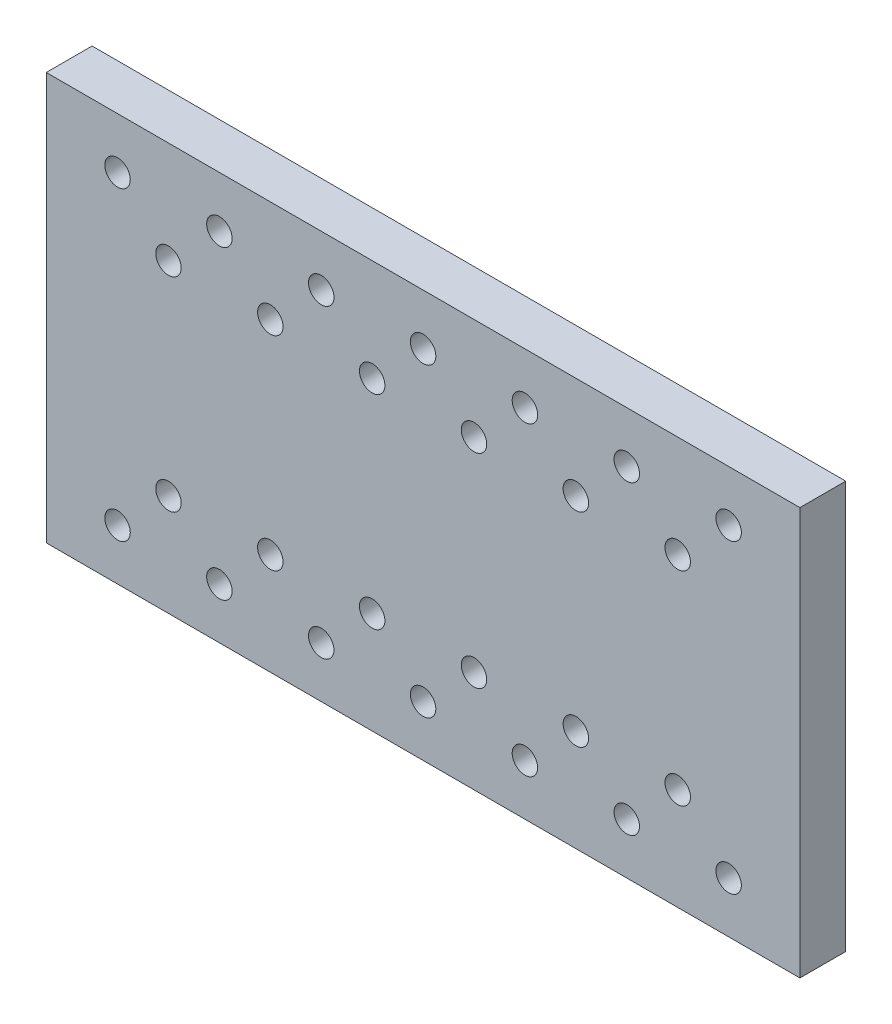
ISO-10303-21;
HEADER;
FILE_DESCRIPTION(('STEP AP214'),'2;1');
FILE_NAME('part.step','',(''),(''),'','','');
FILE_SCHEMA(('AUTOMOTIVE_DESIGN { 1 0 10303 214 1 1 1 1 }'));
ENDSEC;
DATA;
#1=APPLICATION_CONTEXT('core data for automotive mechanical design processes');
#2=APPLICATION_PROTOCOL_DEFINITION('international standard','automotive_design',2000,#1);
#3=PRODUCT_CONTEXT('',#1,'mechanical');
#4=PRODUCT('Part','Part','',(#3));
#5=PRODUCT_RELATED_PRODUCT_CATEGORY('part','',(#4));
#6=PRODUCT_DEFINITION_FORMATION('','',#4);
#7=PRODUCT_DEFINITION_CONTEXT('part definition',#1,'design');
#8=PRODUCT_DEFINITION('design','',#6,#7);
#9=PRODUCT_DEFINITION_SHAPE('','',#8);
#10=(LENGTH_UNIT() NAMED_UNIT(*) SI_UNIT(.MILLI.,.METRE.));
#11=(NAMED_UNIT(*) PLANE_ANGLE_UNIT() SI_UNIT($,.RADIAN.));
#12=(NAMED_UNIT(*) SI_UNIT($,.STERADIAN.) SOLID_ANGLE_UNIT());
#13=UNCERTAINTY_MEASURE_WITH_UNIT(LENGTH_MEASURE(1.E-05),#10,'distance_accuracy_value','');
#14=(GEOMETRIC_REPRESENTATION_CONTEXT(3) GLOBAL_UNCERTAINTY_ASSIGNED_CONTEXT((#13)) GLOBAL_UNIT_ASSIGNED_CONTEXT((#10,
#11,#12)) REPRESENTATION_CONTEXT('',''));
#15=CARTESIAN_POINT('',(0.,0.,0.));
#16=DIRECTION('',(0.,0.,1.));
#17=DIRECTION('',(1.,0.,0.));
#18=AXIS2_PLACEMENT_3D('',#15,#16,#17);
#19=CARTESIAN_POINT('',(0.,101.6,11.43));
#20=DIRECTION('',(0.,0.,1.));
#21=DIRECTION('',(1.,0.,0.));
#22=AXIS2_PLACEMENT_3D('',#19,#20,#21);
#23=PLANE('',#22);
#24=CARTESIAN_POINT('',(-55.88,25.4,11.43));
#25=DIRECTION('',(0.,0.,1.));
#26=DIRECTION('',(1.,0.,0.));
#27=AXIS2_PLACEMENT_3D('',#24,#25,#26);
#28=CIRCLE('',#27,3.175);
#29=CARTESIAN_POINT('',(-52.705,25.4,11.43));
#30=VERTEX_POINT('',#29);
#31=EDGE_CURVE('E255',#30,#30,#28,.T.);
#32=ORIENTED_EDGE('',*,*,#31,.F.);
#33=EDGE_LOOP('',(#32));
#34=FACE_BOUND('',#33,.T.);
#35=CARTESIAN_POINT('',(-30.48,76.2,11.43));
#36=DIRECTION('',(0.,0.,1.));
#37=DIRECTION('',(1.,0.,0.));
#38=AXIS2_PLACEMENT_3D('',#35,#36,#37);
#39=CIRCLE('',#38,3.175);
#40=CARTESIAN_POINT('',(-27.305,76.2,11.43));
#41=VERTEX_POINT('',#40);
#42=EDGE_CURVE('E243',#41,#41,#39,.T.);
#43=ORIENTED_EDGE('',*,*,#42,.F.);
#44=EDGE_LOOP('',(#43));
#45=FACE_BOUND('',#44,.T.);
#46=CARTESIAN_POINT('',(-81.28,76.2,11.43));
#47=DIRECTION('',(0.,0.,1.));
#48=DIRECTION('',(1.,0.,0.));
#49=AXIS2_PLACEMENT_3D('',#46,#47,#48);
#50=CIRCLE('',#49,3.175);
#51=CARTESIAN_POINT('',(-78.105,76.2,11.43));
#52=VERTEX_POINT('',#51);
#53=EDGE_CURVE('E231',#52,#52,#50,.T.);
#54=ORIENTED_EDGE('',*,*,#53,.F.);
#55=EDGE_LOOP('',(#54));
#56=FACE_BOUND('',#55,.T.);
#57=CARTESIAN_POINT('',(-132.08,25.4,11.43));
#58=DIRECTION('',(0.,0.,1.));
#59=DIRECTION('',(1.,0.,0.));
#60=AXIS2_PLACEMENT_3D('',#57,#58,#59);
#61=CIRCLE('',#60,3.175);
#62=CARTESIAN_POINT('',(-128.905,25.4,11.43));
#63=VERTEX_POINT('',#62);
#64=EDGE_CURVE('E219',#63,#63,#61,.T.);
#65=ORIENTED_EDGE('',*,*,#64,.F.);
#66=EDGE_LOOP('',(#65));
#67=FACE_BOUND('',#66,.T.);
#68=CARTESIAN_POINT('',(-157.48,76.2,11.43));
#69=DIRECTION('',(0.,0.,1.));
#70=DIRECTION('',(1.,0.,0.));
#71=AXIS2_PLACEMENT_3D('',#68,#69,#70);
#72=CIRCLE('',#71,3.175);
#73=CARTESIAN_POINT('',(-154.305,76.2,11.43));
#74=VERTEX_POINT('',#73);
#75=EDGE_CURVE('E207',#74,#74,#72,.T.);
#76=ORIENTED_EDGE('',*,*,#75,.F.);
#77=EDGE_LOOP('',(#76));
#78=FACE_BOUND('',#77,.T.);
#79=CARTESIAN_POINT('',(-106.68,76.2,11.43));
#80=DIRECTION('',(0.,0.,1.));
#81=DIRECTION('',(1.,0.,0.));
#82=AXIS2_PLACEMENT_3D('',#79,#80,#81);
#83=CIRCLE('',#82,3.175);
#84=CARTESIAN_POINT('',(-103.505,76.2,11.43));
#85=VERTEX_POINT('',#84);
#86=EDGE_CURVE('E195',#85,#85,#83,.T.);
#87=ORIENTED_EDGE('',*,*,#86,.F.);
#88=EDGE_LOOP('',(#87));
#89=FACE_BOUND('',#88,.T.);
#90=CARTESIAN_POINT('',(-93.98,88.9,11.43));
#91=DIRECTION('',(0.,0.,1.));
#92=DIRECTION('',(1.,0.,0.));
#93=AXIS2_PLACEMENT_3D('',#90,#91,#92);
#94=CIRCLE('',#93,3.175);
#95=CARTESIAN_POINT('',(-90.805,88.9,11.43));
#96=VERTEX_POINT('',#95);
#97=EDGE_CURVE('E183',#96,#96,#94,.T.);
#98=ORIENTED_EDGE('',*,*,#97,.F.);
#99=EDGE_LOOP('',(#98));
#100=FACE_BOUND('',#99,.T.);
#101=CARTESIAN_POINT('',(-119.38,12.7,11.43));
#102=DIRECTION('',(0.,0.,1.));
#103=DIRECTION('',(1.,0.,0.));
#104=AXIS2_PLACEMENT_3D('',#101,#102,#103);
#105=CIRCLE('',#104,3.175);
#106=CARTESIAN_POINT('',(-116.205,12.7,11.43));
#107=VERTEX_POINT('',#106);
#108=EDGE_CURVE('E171',#107,#107,#105,.T.);
#109=ORIENTED_EDGE('',*,*,#108,.F.);
#110=EDGE_LOOP('',(#109));
#111=FACE_BOUND('',#110,.T.);
#112=CARTESIAN_POINT('',(-119.38,88.9,11.43));
#113=DIRECTION('',(0.,0.,1.));
#114=DIRECTION('',(1.,0.,0.));
#115=AXIS2_PLACEMENT_3D('',#112,#113,#114);
#116=CIRCLE('',#115,3.175);
#117=CARTESIAN_POINT('',(-116.205,88.9,11.43));
#118=VERTEX_POINT('',#117);
#119=EDGE_CURVE('E159',#118,#118,#116,.T.);
#120=ORIENTED_EDGE('',*,*,#119,.F.);
#121=EDGE_LOOP('',(#120));
#122=FACE_BOUND('',#121,.T.);
#123=CARTESIAN_POINT('',(-144.78,12.7,11.43));
#124=DIRECTION('',(0.,0.,1.));
#125=DIRECTION('',(1.,0.,0.));
#126=AXIS2_PLACEMENT_3D('',#123,#124,#125);
#127=CIRCLE('',#126,3.175);
#128=CARTESIAN_POINT('',(-141.605,12.7,11.43));
#129=VERTEX_POINT('',#128);
#130=EDGE_CURVE('E147',#129,#129,#127,.T.);
#131=ORIENTED_EDGE('',*,*,#130,.F.);
#132=EDGE_LOOP('',(#131));
#133=FACE_BOUND('',#132,.T.);
#134=CARTESIAN_POINT('',(-170.18,88.9,11.43));
#135=DIRECTION('',(0.,0.,1.));
#136=DIRECTION('',(1.,0.,0.));
#137=AXIS2_PLACEMENT_3D('',#134,#135,#136);
#138=CIRCLE('',#137,3.17499999999997);
#139=CARTESIAN_POINT('',(-167.005,88.9,11.43));
#140=VERTEX_POINT('',#139);
#141=EDGE_CURVE('E135',#140,#140,#138,.T.);
#142=ORIENTED_EDGE('',*,*,#141,.F.);
#143=EDGE_LOOP('',(#142));
#144=FACE_BOUND('',#143,.T.);
#145=CARTESIAN_POINT('',(-43.18,12.7,11.43));
#146=DIRECTION('',(0.,0.,1.));
#147=DIRECTION('',(1.,0.,0.));
#148=AXIS2_PLACEMENT_3D('',#145,#146,#147);
#149=CIRCLE('',#148,3.175);
#150=CARTESIAN_POINT('',(-40.005,12.7,11.43));
#151=VERTEX_POINT('',#150);
#152=EDGE_CURVE('E123',#151,#151,#149,.T.);
#153=ORIENTED_EDGE('',*,*,#152,.F.);
#154=EDGE_LOOP('',(#153));
#155=FACE_BOUND('',#154,.T.);
#156=CARTESIAN_POINT('',(-17.78,88.9,11.43));
#157=DIRECTION('',(0.,0.,1.));
#158=DIRECTION('',(1.,0.,0.));
#159=AXIS2_PLACEMENT_3D('',#156,#157,#158);
#160=CIRCLE('',#159,3.175);
#161=CARTESIAN_POINT('',(-14.605,88.9,11.43));
#162=VERTEX_POINT('',#161);
#163=EDGE_CURVE('E102',#162,#162,#160,.T.);
#164=ORIENTED_EDGE('',*,*,#163,.F.);
#165=EDGE_LOOP('',(#164));
#166=FACE_BOUND('',#165,.T.);
#167=DIRECTION('',(0.,1.,0.));
#168=VECTOR('',#167,1.);
#169=CARTESIAN_POINT('',(0.,0.,11.43));
#170=LINE('',#169,#168);
#171=CARTESIAN_POINT('',(0.,0.,11.43));
#172=VERTEX_POINT('',#171);
#173=CARTESIAN_POINT('',(0.,101.6,11.43));
#174=VERTEX_POINT('',#173);
#175=EDGE_CURVE('E87',#172,#174,#170,.T.);
#176=ORIENTED_EDGE('',*,*,#175,.T.);
#177=DIRECTION('',(-1.,0.,0.));
#178=VECTOR('',#177,1.);
#179=CARTESIAN_POINT('',(0.,101.6,11.43));
#180=LINE('',#179,#178);
#181=CARTESIAN_POINT('',(-187.96,101.6,11.43));
#182=VERTEX_POINT('',#181);
#183=EDGE_CURVE('E82',#174,#182,#180,.T.);
#184=ORIENTED_EDGE('',*,*,#183,.T.);
#185=DIRECTION('',(0.,-1.,0.));
#186=VECTOR('',#185,1.);
#187=CARTESIAN_POINT('',(-187.96,0.,11.43));
#188=LINE('',#187,#186);
#189=CARTESIAN_POINT('',(-187.96,0.,11.43));
#190=VERTEX_POINT('',#189);
#191=EDGE_CURVE('E85',#182,#190,#188,.T.);
#192=ORIENTED_EDGE('',*,*,#191,.T.);
#193=DIRECTION('',(1.,0.,0.));
#194=VECTOR('',#193,1.);
#195=CARTESIAN_POINT('',(0.,0.,11.43));
#196=LINE('',#195,#194);
#197=EDGE_CURVE('E52',#190,#172,#196,.T.);
#198=ORIENTED_EDGE('',*,*,#197,.T.);
#199=EDGE_LOOP('',(#176,#184,#192,#198));
#200=FACE_BOUND('',#199,.T.);
#201=CARTESIAN_POINT('',(-17.78,12.7,11.43));
#202=DIRECTION('',(0.,0.,1.));
#203=DIRECTION('',(1.,0.,0.));
#204=AXIS2_PLACEMENT_3D('',#201,#202,#203);
#205=CIRCLE('',#204,3.175);
#206=CARTESIAN_POINT('',(-14.605,12.7,11.43));
#207=VERTEX_POINT('',#206);
#208=EDGE_CURVE('E117',#207,#207,#205,.T.);
#209=ORIENTED_EDGE('',*,*,#208,.F.);
#210=EDGE_LOOP('',(#209));
#211=FACE_BOUND('',#210,.T.);
#212=CARTESIAN_POINT('',(-43.18,88.9,11.43));
#213=DIRECTION('',(0.,0.,1.));
#214=DIRECTION('',(1.,0.,0.));
#215=AXIS2_PLACEMENT_3D('',#212,#213,#214);
#216=CIRCLE('',#215,3.175);
#217=CARTESIAN_POINT('',(-40.005,88.9,11.43));
#218=VERTEX_POINT('',#217);
#219=EDGE_CURVE('E129',#218,#218,#216,.T.);
#220=ORIENTED_EDGE('',*,*,#219,.F.);
#221=EDGE_LOOP('',(#220));
#222=FACE_BOUND('',#221,.T.);
#223=CARTESIAN_POINT('',(-170.18,12.7,11.43));
#224=DIRECTION('',(0.,0.,1.));
#225=DIRECTION('',(1.,0.,0.));
#226=AXIS2_PLACEMENT_3D('',#223,#224,#225);
#227=CIRCLE('',#226,3.175);
#228=CARTESIAN_POINT('',(-167.005,12.7,11.43));
#229=VERTEX_POINT('',#228);
#230=EDGE_CURVE('E141',#229,#229,#227,.T.);
#231=ORIENTED_EDGE('',*,*,#230,.F.);
#232=EDGE_LOOP('',(#231));
#233=FACE_BOUND('',#232,.T.);
#234=CARTESIAN_POINT('',(-144.78,88.9,11.43));
#235=DIRECTION('',(0.,0.,1.));
#236=DIRECTION('',(1.,0.,0.));
#237=AXIS2_PLACEMENT_3D('',#234,#235,#236);
#238=CIRCLE('',#237,3.17499999999997);
#239=CARTESIAN_POINT('',(-141.605,88.9,11.43));
#240=VERTEX_POINT('',#239);
#241=EDGE_CURVE('E153',#240,#240,#238,.T.);
#242=ORIENTED_EDGE('',*,*,#241,.F.);
#243=EDGE_LOOP('',(#242));
#244=FACE_BOUND('',#243,.T.);
#245=CARTESIAN_POINT('',(-68.58,88.9,11.43));
#246=DIRECTION('',(0.,0.,1.));
#247=DIRECTION('',(1.,0.,0.));
#248=AXIS2_PLACEMENT_3D('',#245,#246,#247);
#249=CIRCLE('',#248,3.175);
#250=CARTESIAN_POINT('',(-65.405,88.9,11.43));
#251=VERTEX_POINT('',#250);
#252=EDGE_CURVE('E165',#251,#251,#249,.T.);
#253=ORIENTED_EDGE('',*,*,#252,.F.);
#254=EDGE_LOOP('',(#253));
#255=FACE_BOUND('',#254,.T.);
#256=CARTESIAN_POINT('',(-68.58,12.7,11.43));
#257=DIRECTION('',(0.,0.,1.));
#258=DIRECTION('',(1.,0.,0.));
#259=AXIS2_PLACEMENT_3D('',#256,#257,#258);
#260=CIRCLE('',#259,3.175);
#261=CARTESIAN_POINT('',(-65.405,12.7,11.43));
#262=VERTEX_POINT('',#261);
#263=EDGE_CURVE('E177',#262,#262,#260,.T.);
#264=ORIENTED_EDGE('',*,*,#263,.F.);
#265=EDGE_LOOP('',(#264));
#266=FACE_BOUND('',#265,.T.);
#267=CARTESIAN_POINT('',(-93.98,12.7,11.43));
#268=DIRECTION('',(0.,0.,1.));
#269=DIRECTION('',(1.,0.,0.));
#270=AXIS2_PLACEMENT_3D('',#267,#268,#269);
#271=CIRCLE('',#270,3.175);
#272=CARTESIAN_POINT('',(-90.805,12.7,11.43));
#273=VERTEX_POINT('',#272);
#274=EDGE_CURVE('E189',#273,#273,#271,.T.);
#275=ORIENTED_EDGE('',*,*,#274,.F.);
#276=EDGE_LOOP('',(#275));
#277=FACE_BOUND('',#276,.T.);
#278=CARTESIAN_POINT('',(-132.08,76.2,11.43));
#279=DIRECTION('',(0.,0.,1.));
#280=DIRECTION('',(1.,0.,0.));
#281=AXIS2_PLACEMENT_3D('',#278,#279,#280);
#282=CIRCLE('',#281,3.17499999999997);
#283=CARTESIAN_POINT('',(-128.905,76.2,11.43));
#284=VERTEX_POINT('',#283);
#285=EDGE_CURVE('E201',#284,#284,#282,.T.);
#286=ORIENTED_EDGE('',*,*,#285,.F.);
#287=EDGE_LOOP('',(#286));
#288=FACE_BOUND('',#287,.T.);
#289=CARTESIAN_POINT('',(-106.68,25.4,11.43));
#290=DIRECTION('',(0.,0.,1.));
#291=DIRECTION('',(1.,0.,0.));
#292=AXIS2_PLACEMENT_3D('',#289,#290,#291);
#293=CIRCLE('',#292,3.175);
#294=CARTESIAN_POINT('',(-103.505,25.4,11.43));
#295=VERTEX_POINT('',#294);
#296=EDGE_CURVE('E213',#295,#295,#293,.T.);
#297=ORIENTED_EDGE('',*,*,#296,.F.);
#298=EDGE_LOOP('',(#297));
#299=FACE_BOUND('',#298,.T.);
#300=CARTESIAN_POINT('',(-157.48,25.4,11.43));
#301=DIRECTION('',(0.,0.,1.));
#302=DIRECTION('',(1.,0.,0.));
#303=AXIS2_PLACEMENT_3D('',#300,#301,#302);
#304=CIRCLE('',#303,3.175);
#305=CARTESIAN_POINT('',(-154.305,25.4,11.43));
#306=VERTEX_POINT('',#305);
#307=EDGE_CURVE('E225',#306,#306,#304,.T.);
#308=ORIENTED_EDGE('',*,*,#307,.F.);
#309=EDGE_LOOP('',(#308));
#310=FACE_BOUND('',#309,.T.);
#311=CARTESIAN_POINT('',(-55.88,76.2,11.43));
#312=DIRECTION('',(0.,0.,1.));
#313=DIRECTION('',(1.,0.,0.));
#314=AXIS2_PLACEMENT_3D('',#311,#312,#313);
#315=CIRCLE('',#314,3.175);
#316=CARTESIAN_POINT('',(-52.705,76.2,11.43));
#317=VERTEX_POINT('',#316);
#318=EDGE_CURVE('E237',#317,#317,#315,.T.);
#319=ORIENTED_EDGE('',*,*,#318,.F.);
#320=EDGE_LOOP('',(#319));
#321=FACE_BOUND('',#320,.T.);
#322=CARTESIAN_POINT('',(-81.28,25.4,11.43));
#323=DIRECTION('',(0.,0.,1.));
#324=DIRECTION('',(1.,0.,0.));
#325=AXIS2_PLACEMENT_3D('',#322,#323,#324);
#326=CIRCLE('',#325,3.175);
#327=CARTESIAN_POINT('',(-78.105,25.4,11.43));
#328=VERTEX_POINT('',#327);
#329=EDGE_CURVE('E249',#328,#328,#326,.T.);
#330=ORIENTED_EDGE('',*,*,#329,.F.);
#331=EDGE_LOOP('',(#330));
#332=FACE_BOUND('',#331,.T.);
#333=CARTESIAN_POINT('',(-30.48,25.4,11.43));
#334=DIRECTION('',(0.,0.,1.));
#335=DIRECTION('',(1.,0.,0.));
#336=AXIS2_PLACEMENT_3D('',#333,#334,#335);
#337=CIRCLE('',#336,3.175);
#338=CARTESIAN_POINT('',(-27.305,25.4,11.43));
#339=VERTEX_POINT('',#338);
#340=EDGE_CURVE('E261',#339,#339,#337,.T.);
#341=ORIENTED_EDGE('',*,*,#340,.F.);
#342=EDGE_LOOP('',(#341));
#343=FACE_BOUND('',#342,.T.);
#344=ADVANCED_FACE('F35',(#34,#45,#56,#67,#78,#89,#100,#111,#122,#133,#144,#155,#166,#200,#211,
#222,#233,#244,#255,#266,#277,#288,#299,#310,#321,#332,#343),#23,.T.);
#345=CARTESIAN_POINT('',(0.,101.6,0.));
#346=DIRECTION('',(0.,0.,1.));
#347=DIRECTION('',(1.,0.,0.));
#348=AXIS2_PLACEMENT_3D('',#345,#346,#347);
#349=PLANE('',#348);
#350=CARTESIAN_POINT('',(-55.88,25.4,0.));
#351=DIRECTION('',(0.,0.,1.));
#352=DIRECTION('',(1.,0.,0.));
#353=AXIS2_PLACEMENT_3D('',#350,#351,#352);
#354=CIRCLE('',#353,3.175);
#355=CARTESIAN_POINT('',(-52.705,25.4,0.));
#356=VERTEX_POINT('',#355);
#357=EDGE_CURVE('E258',#356,#356,#354,.T.);
#358=ORIENTED_EDGE('',*,*,#357,.T.);
#359=EDGE_LOOP('',(#358));
#360=FACE_BOUND('',#359,.T.);
#361=CARTESIAN_POINT('',(-30.48,76.2,0.));
#362=DIRECTION('',(0.,0.,1.));
#363=DIRECTION('',(1.,0.,0.));
#364=AXIS2_PLACEMENT_3D('',#361,#362,#363);
#365=CIRCLE('',#364,3.175);
#366=CARTESIAN_POINT('',(-27.305,76.2,0.));
#367=VERTEX_POINT('',#366);
#368=EDGE_CURVE('E246',#367,#367,#365,.T.);
#369=ORIENTED_EDGE('',*,*,#368,.T.);
#370=EDGE_LOOP('',(#369));
#371=FACE_BOUND('',#370,.T.);
#372=CARTESIAN_POINT('',(-81.28,76.2,0.));
#373=DIRECTION('',(0.,0.,1.));
#374=DIRECTION('',(1.,0.,0.));
#375=AXIS2_PLACEMENT_3D('',#372,#373,#374);
#376=CIRCLE('',#375,3.175);
#377=CARTESIAN_POINT('',(-78.105,76.2,0.));
#378=VERTEX_POINT('',#377);
#379=EDGE_CURVE('E234',#378,#378,#376,.T.);
#380=ORIENTED_EDGE('',*,*,#379,.T.);
#381=EDGE_LOOP('',(#380));
#382=FACE_BOUND('',#381,.T.);
#383=CARTESIAN_POINT('',(-132.08,25.4,0.));
#384=DIRECTION('',(0.,0.,1.));
#385=DIRECTION('',(1.,0.,0.));
#386=AXIS2_PLACEMENT_3D('',#383,#384,#385);
#387=CIRCLE('',#386,3.175);
#388=CARTESIAN_POINT('',(-128.905,25.4,0.));
#389=VERTEX_POINT('',#388);
#390=EDGE_CURVE('E222',#389,#389,#387,.T.);
#391=ORIENTED_EDGE('',*,*,#390,.T.);
#392=EDGE_LOOP('',(#391));
#393=FACE_BOUND('',#392,.T.);
#394=CARTESIAN_POINT('',(-157.48,76.2,0.));
#395=DIRECTION('',(0.,0.,1.));
#396=DIRECTION('',(1.,0.,0.));
#397=AXIS2_PLACEMENT_3D('',#394,#395,#396);
#398=CIRCLE('',#397,3.175);
#399=CARTESIAN_POINT('',(-154.305,76.2,0.));
#400=VERTEX_POINT('',#399);
#401=EDGE_CURVE('E210',#400,#400,#398,.T.);
#402=ORIENTED_EDGE('',*,*,#401,.T.);
#403=EDGE_LOOP('',(#402));
#404=FACE_BOUND('',#403,.T.);
#405=CARTESIAN_POINT('',(-106.68,76.2,0.));
#406=DIRECTION('',(0.,0.,1.));
#407=DIRECTION('',(1.,0.,0.));
#408=AXIS2_PLACEMENT_3D('',#405,#406,#407);
#409=CIRCLE('',#408,3.175);
#410=CARTESIAN_POINT('',(-103.505,76.2,0.));
#411=VERTEX_POINT('',#410);
#412=EDGE_CURVE('E198',#411,#411,#409,.T.);
#413=ORIENTED_EDGE('',*,*,#412,.T.);
#414=EDGE_LOOP('',(#413));
#415=FACE_BOUND('',#414,.T.);
#416=CARTESIAN_POINT('',(-93.98,88.9,0.));
#417=DIRECTION('',(0.,0.,1.));
#418=DIRECTION('',(1.,0.,0.));
#419=AXIS2_PLACEMENT_3D('',#416,#417,#418);
#420=CIRCLE('',#419,3.175);
#421=CARTESIAN_POINT('',(-90.805,88.9,0.));
#422=VERTEX_POINT('',#421);
#423=EDGE_CURVE('E186',#422,#422,#420,.T.);
#424=ORIENTED_EDGE('',*,*,#423,.T.);
#425=EDGE_LOOP('',(#424));
#426=FACE_BOUND('',#425,.T.);
#427=CARTESIAN_POINT('',(-119.38,12.7,0.));
#428=DIRECTION('',(0.,0.,1.));
#429=DIRECTION('',(1.,0.,0.));
#430=AXIS2_PLACEMENT_3D('',#427,#428,#429);
#431=CIRCLE('',#430,3.175);
#432=CARTESIAN_POINT('',(-116.205,12.7,0.));
#433=VERTEX_POINT('',#432);
#434=EDGE_CURVE('E174',#433,#433,#431,.T.);
#435=ORIENTED_EDGE('',*,*,#434,.T.);
#436=EDGE_LOOP('',(#435));
#437=FACE_BOUND('',#436,.T.);
#438=CARTESIAN_POINT('',(-119.38,88.9,0.));
#439=DIRECTION('',(0.,0.,1.));
#440=DIRECTION('',(1.,0.,0.));
#441=AXIS2_PLACEMENT_3D('',#438,#439,#440);
#442=CIRCLE('',#441,3.175);
#443=CARTESIAN_POINT('',(-116.205,88.9,0.));
#444=VERTEX_POINT('',#443);
#445=EDGE_CURVE('E162',#444,#444,#442,.T.);
#446=ORIENTED_EDGE('',*,*,#445,.T.);
#447=EDGE_LOOP('',(#446));
#448=FACE_BOUND('',#447,.T.);
#449=CARTESIAN_POINT('',(-144.78,12.7,0.));
#450=DIRECTION('',(0.,0.,1.));
#451=DIRECTION('',(1.,0.,0.));
#452=AXIS2_PLACEMENT_3D('',#449,#450,#451);
#453=CIRCLE('',#452,3.175);
#454=CARTESIAN_POINT('',(-141.605,12.7,0.));
#455=VERTEX_POINT('',#454);
#456=EDGE_CURVE('E150',#455,#455,#453,.T.);
#457=ORIENTED_EDGE('',*,*,#456,.T.);
#458=EDGE_LOOP('',(#457));
#459=FACE_BOUND('',#458,.T.);
#460=CARTESIAN_POINT('',(-170.18,88.9,0.));
#461=DIRECTION('',(0.,0.,1.));
#462=DIRECTION('',(1.,0.,0.));
#463=AXIS2_PLACEMENT_3D('',#460,#461,#462);
#464=CIRCLE('',#463,3.17499999999997);
#465=CARTESIAN_POINT('',(-167.005,88.9,0.));
#466=VERTEX_POINT('',#465);
#467=EDGE_CURVE('E138',#466,#466,#464,.T.);
#468=ORIENTED_EDGE('',*,*,#467,.T.);
#469=EDGE_LOOP('',(#468));
#470=FACE_BOUND('',#469,.T.);
#471=CARTESIAN_POINT('',(-43.18,12.7,0.));
#472=DIRECTION('',(0.,0.,1.));
#473=DIRECTION('',(1.,0.,0.));
#474=AXIS2_PLACEMENT_3D('',#471,#472,#473);
#475=CIRCLE('',#474,3.175);
#476=CARTESIAN_POINT('',(-40.005,12.7,0.));
#477=VERTEX_POINT('',#476);
#478=EDGE_CURVE('E126',#477,#477,#475,.T.);
#479=ORIENTED_EDGE('',*,*,#478,.T.);
#480=EDGE_LOOP('',(#479));
#481=FACE_BOUND('',#480,.T.);
#482=CARTESIAN_POINT('',(-17.78,88.9,0.));
#483=DIRECTION('',(0.,0.,1.));
#484=DIRECTION('',(1.,0.,0.));
#485=AXIS2_PLACEMENT_3D('',#482,#483,#484);
#486=CIRCLE('',#485,3.175);
#487=CARTESIAN_POINT('',(-14.605,88.9,0.));
#488=VERTEX_POINT('',#487);
#489=EDGE_CURVE('E114',#488,#488,#486,.T.);
#490=ORIENTED_EDGE('',*,*,#489,.T.);
#491=EDGE_LOOP('',(#490));
#492=FACE_BOUND('',#491,.T.);
#493=DIRECTION('',(0.,1.,0.));
#494=VECTOR('',#493,1.);
#495=CARTESIAN_POINT('',(0.,0.,0.));
#496=LINE('',#495,#494);
#497=CARTESIAN_POINT('',(0.,0.,0.));
#498=VERTEX_POINT('',#497);
#499=CARTESIAN_POINT('',(0.,101.6,0.));
#500=VERTEX_POINT('',#499);
#501=EDGE_CURVE('E99',#498,#500,#496,.T.);
#502=ORIENTED_EDGE('',*,*,#501,.F.);
#503=DIRECTION('',(1.,0.,0.));
#504=VECTOR('',#503,1.);
#505=CARTESIAN_POINT('',(0.,0.,0.));
#506=LINE('',#505,#504);
#507=CARTESIAN_POINT('',(-187.96,0.,0.));
#508=VERTEX_POINT('',#507);
#509=EDGE_CURVE('E75',#508,#498,#506,.T.);
#510=ORIENTED_EDGE('',*,*,#509,.F.);
#511=DIRECTION('',(0.,-1.,0.));
#512=VECTOR('',#511,1.);
#513=CARTESIAN_POINT('',(-187.96,0.,0.));
#514=LINE('',#513,#512);
#515=CARTESIAN_POINT('',(-187.96,101.6,0.));
#516=VERTEX_POINT('',#515);
#517=EDGE_CURVE('E69',#516,#508,#514,.T.);
#518=ORIENTED_EDGE('',*,*,#517,.F.);
#519=DIRECTION('',(-1.,0.,0.));
#520=VECTOR('',#519,1.);
#521=CARTESIAN_POINT('',(0.,101.6,0.));
#522=LINE('',#521,#520);
#523=EDGE_CURVE('E91',#500,#516,#522,.T.);
#524=ORIENTED_EDGE('',*,*,#523,.F.);
#525=EDGE_LOOP('',(#502,#510,#518,#524));
#526=FACE_BOUND('',#525,.T.);
#527=CARTESIAN_POINT('',(-17.78,12.7,0.));
#528=DIRECTION('',(0.,0.,1.));
#529=DIRECTION('',(1.,0.,0.));
#530=AXIS2_PLACEMENT_3D('',#527,#528,#529);
#531=CIRCLE('',#530,3.175);
#532=CARTESIAN_POINT('',(-14.605,12.7,0.));
#533=VERTEX_POINT('',#532);
#534=EDGE_CURVE('E120',#533,#533,#531,.T.);
#535=ORIENTED_EDGE('',*,*,#534,.T.);
#536=EDGE_LOOP('',(#535));
#537=FACE_BOUND('',#536,.T.);
#538=CARTESIAN_POINT('',(-43.18,88.9,0.));
#539=DIRECTION('',(0.,0.,1.));
#540=DIRECTION('',(1.,0.,0.));
#541=AXIS2_PLACEMENT_3D('',#538,#539,#540);
#542=CIRCLE('',#541,3.175);
#543=CARTESIAN_POINT('',(-40.005,88.9,0.));
#544=VERTEX_POINT('',#543);
#545=EDGE_CURVE('E132',#544,#544,#542,.T.);
#546=ORIENTED_EDGE('',*,*,#545,.T.);
#547=EDGE_LOOP('',(#546));
#548=FACE_BOUND('',#547,.T.);
#549=CARTESIAN_POINT('',(-170.18,12.7,0.));
#550=DIRECTION('',(0.,0.,1.));
#551=DIRECTION('',(1.,0.,0.));
#552=AXIS2_PLACEMENT_3D('',#549,#550,#551);
#553=CIRCLE('',#552,3.175);
#554=CARTESIAN_POINT('',(-167.005,12.7,0.));
#555=VERTEX_POINT('',#554);
#556=EDGE_CURVE('E144',#555,#555,#553,.T.);
#557=ORIENTED_EDGE('',*,*,#556,.T.);
#558=EDGE_LOOP('',(#557));
#559=FACE_BOUND('',#558,.T.);
#560=CARTESIAN_POINT('',(-144.78,88.9,0.));
#561=DIRECTION('',(0.,0.,1.));
#562=DIRECTION('',(1.,0.,0.));
#563=AXIS2_PLACEMENT_3D('',#560,#561,#562);
#564=CIRCLE('',#563,3.17499999999997);
#565=CARTESIAN_POINT('',(-141.605,88.9,0.));
#566=VERTEX_POINT('',#565);
#567=EDGE_CURVE('E156',#566,#566,#564,.T.);
#568=ORIENTED_EDGE('',*,*,#567,.T.);
#569=EDGE_LOOP('',(#568));
#570=FACE_BOUND('',#569,.T.);
#571=CARTESIAN_POINT('',(-68.58,88.9,0.));
#572=DIRECTION('',(0.,0.,1.));
#573=DIRECTION('',(1.,0.,0.));
#574=AXIS2_PLACEMENT_3D('',#571,#572,#573);
#575=CIRCLE('',#574,3.175);
#576=CARTESIAN_POINT('',(-65.405,88.9,0.));
#577=VERTEX_POINT('',#576);
#578=EDGE_CURVE('E168',#577,#577,#575,.T.);
#579=ORIENTED_EDGE('',*,*,#578,.T.);
#580=EDGE_LOOP('',(#579));
#581=FACE_BOUND('',#580,.T.);
#582=CARTESIAN_POINT('',(-68.58,12.7,0.));
#583=DIRECTION('',(0.,0.,1.));
#584=DIRECTION('',(1.,0.,0.));
#585=AXIS2_PLACEMENT_3D('',#582,#583,#584);
#586=CIRCLE('',#585,3.175);
#587=CARTESIAN_POINT('',(-65.405,12.7,0.));
#588=VERTEX_POINT('',#587);
#589=EDGE_CURVE('E180',#588,#588,#586,.T.);
#590=ORIENTED_EDGE('',*,*,#589,.T.);
#591=EDGE_LOOP('',(#590));
#592=FACE_BOUND('',#591,.T.);
#593=CARTESIAN_POINT('',(-93.98,12.7,0.));
#594=DIRECTION('',(0.,0.,1.));
#595=DIRECTION('',(1.,0.,0.));
#596=AXIS2_PLACEMENT_3D('',#593,#594,#595);
#597=CIRCLE('',#596,3.175);
#598=CARTESIAN_POINT('',(-90.805,12.7,0.));
#599=VERTEX_POINT('',#598);
#600=EDGE_CURVE('E192',#599,#599,#597,.T.);
#601=ORIENTED_EDGE('',*,*,#600,.T.);
#602=EDGE_LOOP('',(#601));
#603=FACE_BOUND('',#602,.T.);
#604=CARTESIAN_POINT('',(-132.08,76.2,0.));
#605=DIRECTION('',(0.,0.,1.));
#606=DIRECTION('',(1.,0.,0.));
#607=AXIS2_PLACEMENT_3D('',#604,#605,#606);
#608=CIRCLE('',#607,3.17499999999997);
#609=CARTESIAN_POINT('',(-128.905,76.2,0.));
#610=VERTEX_POINT('',#609);
#611=EDGE_CURVE('E204',#610,#610,#608,.T.);
#612=ORIENTED_EDGE('',*,*,#611,.T.);
#613=EDGE_LOOP('',(#612));
#614=FACE_BOUND('',#613,.T.);
#615=CARTESIAN_POINT('',(-106.68,25.4,0.));
#616=DIRECTION('',(0.,0.,1.));
#617=DIRECTION('',(1.,0.,0.));
#618=AXIS2_PLACEMENT_3D('',#615,#616,#617);
#619=CIRCLE('',#618,3.175);
#620=CARTESIAN_POINT('',(-103.505,25.4,0.));
#621=VERTEX_POINT('',#620);
#622=EDGE_CURVE('E216',#621,#621,#619,.T.);
#623=ORIENTED_EDGE('',*,*,#622,.T.);
#624=EDGE_LOOP('',(#623));
#625=FACE_BOUND('',#624,.T.);
#626=CARTESIAN_POINT('',(-157.48,25.4,0.));
#627=DIRECTION('',(0.,0.,1.));
#628=DIRECTION('',(1.,0.,0.));
#629=AXIS2_PLACEMENT_3D('',#626,#627,#628);
#630=CIRCLE('',#629,3.175);
#631=CARTESIAN_POINT('',(-154.305,25.4,0.));
#632=VERTEX_POINT('',#631);
#633=EDGE_CURVE('E228',#632,#632,#630,.T.);
#634=ORIENTED_EDGE('',*,*,#633,.T.);
#635=EDGE_LOOP('',(#634));
#636=FACE_BOUND('',#635,.T.);
#637=CARTESIAN_POINT('',(-55.88,76.2,0.));
#638=DIRECTION('',(0.,0.,1.));
#639=DIRECTION('',(1.,0.,0.));
#640=AXIS2_PLACEMENT_3D('',#637,#638,#639);
#641=CIRCLE('',#640,3.175);
#642=CARTESIAN_POINT('',(-52.705,76.2,0.));
#643=VERTEX_POINT('',#642);
#644=EDGE_CURVE('E240',#643,#643,#641,.T.);
#645=ORIENTED_EDGE('',*,*,#644,.T.);
#646=EDGE_LOOP('',(#645));
#647=FACE_BOUND('',#646,.T.);
#648=CARTESIAN_POINT('',(-81.28,25.4,0.));
#649=DIRECTION('',(0.,0.,1.));
#650=DIRECTION('',(1.,0.,0.));
#651=AXIS2_PLACEMENT_3D('',#648,#649,#650);
#652=CIRCLE('',#651,3.175);
#653=CARTESIAN_POINT('',(-78.105,25.4,0.));
#654=VERTEX_POINT('',#653);
#655=EDGE_CURVE('E252',#654,#654,#652,.T.);
#656=ORIENTED_EDGE('',*,*,#655,.T.);
#657=EDGE_LOOP('',(#656));
#658=FACE_BOUND('',#657,.T.);
#659=CARTESIAN_POINT('',(-30.48,25.4,0.));
#660=DIRECTION('',(0.,0.,1.));
#661=DIRECTION('',(1.,0.,0.));
#662=AXIS2_PLACEMENT_3D('',#659,#660,#661);
#663=CIRCLE('',#662,3.175);
#664=CARTESIAN_POINT('',(-27.305,25.4,0.));
#665=VERTEX_POINT('',#664);
#666=EDGE_CURVE('E264',#665,#665,#663,.T.);
#667=ORIENTED_EDGE('',*,*,#666,.T.);
#668=EDGE_LOOP('',(#667));
#669=FACE_BOUND('',#668,.T.);
#670=ADVANCED_FACE('F110',(#360,#371,#382,#393,#404,#415,#426,#437,#448,#459,#470,#481,#492,
#526,#537,#548,#559,#570,#581,#592,#603,#614,#625,#636,#647,#658,#669),#349,.F.);
#671=CARTESIAN_POINT('',(0.,0.,11.43));
#672=DIRECTION('',(-1.,0.,0.));
#673=DIRECTION('',(0.,0.,1.));
#674=AXIS2_PLACEMENT_3D('',#671,#672,#673);
#675=PLANE('',#674);
#676=ORIENTED_EDGE('',*,*,#501,.T.);
#677=DIRECTION('',(0.,0.,-1.));
#678=VECTOR('',#677,1.);
#679=CARTESIAN_POINT('',(0.,101.6,11.43));
#680=LINE('',#679,#678);
#681=EDGE_CURVE('E11',#174,#500,#680,.T.);
#682=ORIENTED_EDGE('',*,*,#681,.F.);
#683=ORIENTED_EDGE('',*,*,#175,.F.);
#684=DIRECTION('',(0.,0.,-1.));
#685=VECTOR('',#684,1.);
#686=CARTESIAN_POINT('',(0.,0.,11.43));
#687=LINE('',#686,#685);
#688=EDGE_CURVE('E95',#172,#498,#687,.T.);
#689=ORIENTED_EDGE('',*,*,#688,.T.);
#690=EDGE_LOOP('',(#676,#682,#683,#689));
#691=FACE_BOUND('',#690,.T.);
#692=ADVANCED_FACE('F37',(#691),#675,.F.);
#693=CARTESIAN_POINT('',(0.,101.6,11.43));
#694=DIRECTION('',(0.,-1.,0.));
#695=DIRECTION('',(0.,0.,-1.));
#696=AXIS2_PLACEMENT_3D('',#693,#694,#695);
#697=PLANE('',#696);
#698=ORIENTED_EDGE('',*,*,#523,.T.);
#699=DIRECTION('',(0.,0.,-1.));
#700=VECTOR('',#699,1.);
#701=CARTESIAN_POINT('',(-187.96,101.6,11.43));
#702=LINE('',#701,#700);
#703=EDGE_CURVE('E44',#182,#516,#702,.T.);
#704=ORIENTED_EDGE('',*,*,#703,.F.);
#705=ORIENTED_EDGE('',*,*,#183,.F.);
#706=ORIENTED_EDGE('',*,*,#681,.T.);
#707=EDGE_LOOP('',(#698,#704,#705,#706));
#708=FACE_BOUND('',#707,.T.);
#709=ADVANCED_FACE('F90',(#708),#697,.F.);
#710=CARTESIAN_POINT('',(-187.96,0.,11.43));
#711=DIRECTION('',(1.,0.,0.));
#712=DIRECTION('',(0.,0.,-1.));
#713=AXIS2_PLACEMENT_3D('',#710,#711,#712);
#714=PLANE('',#713);
#715=ORIENTED_EDGE('',*,*,#517,.T.);
#716=DIRECTION('',(0.,0.,-1.));
#717=VECTOR('',#716,1.);
#718=CARTESIAN_POINT('',(-187.96,0.,11.43));
#719=LINE('',#718,#717);
#720=EDGE_CURVE('E92',#190,#508,#719,.T.);
#721=ORIENTED_EDGE('',*,*,#720,.F.);
#722=ORIENTED_EDGE('',*,*,#191,.F.);
#723=ORIENTED_EDGE('',*,*,#703,.T.);
#724=EDGE_LOOP('',(#715,#721,#722,#723));
#725=FACE_BOUND('',#724,.T.);
#726=ADVANCED_FACE('F93',(#725),#714,.F.);
#727=CARTESIAN_POINT('',(0.,0.,11.43));
#728=DIRECTION('',(0.,1.,0.));
#729=DIRECTION('',(-1.,0.,0.));
#730=AXIS2_PLACEMENT_3D('',#727,#728,#729);
#731=PLANE('',#730);
#732=ORIENTED_EDGE('',*,*,#509,.T.);
#733=ORIENTED_EDGE('',*,*,#688,.F.);
#734=ORIENTED_EDGE('',*,*,#197,.F.);
#735=ORIENTED_EDGE('',*,*,#720,.T.);
#736=EDGE_LOOP('',(#732,#733,#734,#735));
#737=FACE_BOUND('',#736,.T.);
#738=ADVANCED_FACE('F107',(#737),#731,.F.);
#739=CARTESIAN_POINT('',(-17.78,88.9,11.43));
#740=DIRECTION('',(0.,0.,-1.));
#741=DIRECTION('',(-1.,0.,0.));
#742=AXIS2_PLACEMENT_3D('',#739,#740,#741);
#743=CYLINDRICAL_SURFACE('',#742,3.175);
#744=ORIENTED_EDGE('',*,*,#163,.T.);
#745=EDGE_LOOP('',(#744));
#746=FACE_BOUND('',#745,.T.);
#747=ORIENTED_EDGE('',*,*,#489,.F.);
#748=EDGE_LOOP('',(#747));
#749=FACE_BOUND('',#748,.T.);
#750=ADVANCED_FACE('F284',(#746,#749),#743,.F.);
#751=CARTESIAN_POINT('',(-17.78,12.7,11.43));
#752=DIRECTION('',(0.,0.,-1.));
#753=DIRECTION('',(-1.,0.,0.));
#754=AXIS2_PLACEMENT_3D('',#751,#752,#753);
#755=CYLINDRICAL_SURFACE('',#754,3.175);
#756=ORIENTED_EDGE('',*,*,#208,.T.);
#757=EDGE_LOOP('',(#756));
#758=FACE_BOUND('',#757,.T.);
#759=ORIENTED_EDGE('',*,*,#534,.F.);
#760=EDGE_LOOP('',(#759));
#761=FACE_BOUND('',#760,.T.);
#762=ADVANCED_FACE('F330',(#758,#761),#755,.F.);
#763=CARTESIAN_POINT('',(-43.18,12.7,11.43));
#764=DIRECTION('',(0.,0.,-1.));
#765=DIRECTION('',(-1.,0.,0.));
#766=AXIS2_PLACEMENT_3D('',#763,#764,#765);
#767=CYLINDRICAL_SURFACE('',#766,3.175);
#768=ORIENTED_EDGE('',*,*,#152,.T.);
#769=EDGE_LOOP('',(#768));
#770=FACE_BOUND('',#769,.T.);
#771=ORIENTED_EDGE('',*,*,#478,.F.);
#772=EDGE_LOOP('',(#771));
#773=FACE_BOUND('',#772,.T.);
#774=ADVANCED_FACE('F338',(#770,#773),#767,.F.);
#775=CARTESIAN_POINT('',(-43.18,88.9,11.43));
#776=DIRECTION('',(0.,0.,-1.));
#777=DIRECTION('',(-1.,0.,0.));
#778=AXIS2_PLACEMENT_3D('',#775,#776,#777);
#779=CYLINDRICAL_SURFACE('',#778,3.175);
#780=ORIENTED_EDGE('',*,*,#219,.T.);
#781=EDGE_LOOP('',(#780));
#782=FACE_BOUND('',#781,.T.);
#783=ORIENTED_EDGE('',*,*,#545,.F.);
#784=EDGE_LOOP('',(#783));
#785=FACE_BOUND('',#784,.T.);
#786=ADVANCED_FACE('F346',(#782,#785),#779,.F.);
#787=CARTESIAN_POINT('',(-170.18,88.9,11.43));
#788=DIRECTION('',(0.,0.,-1.));
#789=DIRECTION('',(-1.,0.,0.));
#790=AXIS2_PLACEMENT_3D('',#787,#788,#789);
#791=CYLINDRICAL_SURFACE('',#790,3.17499999999997);
#792=ORIENTED_EDGE('',*,*,#141,.T.);
#793=EDGE_LOOP('',(#792));
#794=FACE_BOUND('',#793,.T.);
#795=ORIENTED_EDGE('',*,*,#467,.F.);
#796=EDGE_LOOP('',(#795));
#797=FACE_BOUND('',#796,.T.);
#798=ADVANCED_FACE('F355',(#794,#797),#791,.F.);
#799=CARTESIAN_POINT('',(-170.18,12.7,11.43));
#800=DIRECTION('',(0.,0.,-1.));
#801=DIRECTION('',(-1.,0.,0.));
#802=AXIS2_PLACEMENT_3D('',#799,#800,#801);
#803=CYLINDRICAL_SURFACE('',#802,3.175);
#804=ORIENTED_EDGE('',*,*,#230,.T.);
#805=EDGE_LOOP('',(#804));
#806=FACE_BOUND('',#805,.T.);
#807=ORIENTED_EDGE('',*,*,#556,.F.);
#808=EDGE_LOOP('',(#807));
#809=FACE_BOUND('',#808,.T.);
#810=ADVANCED_FACE('F364',(#806,#809),#803,.F.);
#811=CARTESIAN_POINT('',(-144.78,12.7,11.43));
#812=DIRECTION('',(0.,0.,-1.));
#813=DIRECTION('',(-1.,0.,0.));
#814=AXIS2_PLACEMENT_3D('',#811,#812,#813);
#815=CYLINDRICAL_SURFACE('',#814,3.175);
#816=ORIENTED_EDGE('',*,*,#130,.T.);
#817=EDGE_LOOP('',(#816));
#818=FACE_BOUND('',#817,.T.);
#819=ORIENTED_EDGE('',*,*,#456,.F.);
#820=EDGE_LOOP('',(#819));
#821=FACE_BOUND('',#820,.T.);
#822=ADVANCED_FACE('F373',(#818,#821),#815,.F.);
#823=CARTESIAN_POINT('',(-144.78,88.9,11.43));
#824=DIRECTION('',(0.,0.,-1.));
#825=DIRECTION('',(-1.,0.,0.));
#826=AXIS2_PLACEMENT_3D('',#823,#824,#825);
#827=CYLINDRICAL_SURFACE('',#826,3.17499999999997);
#828=ORIENTED_EDGE('',*,*,#241,.T.);
#829=EDGE_LOOP('',(#828));
#830=FACE_BOUND('',#829,.T.);
#831=ORIENTED_EDGE('',*,*,#567,.F.);
#832=EDGE_LOOP('',(#831));
#833=FACE_BOUND('',#832,.T.);
#834=ADVANCED_FACE('F382',(#830,#833),#827,.F.);
#835=CARTESIAN_POINT('',(-119.38,88.9,11.43));
#836=DIRECTION('',(0.,0.,-1.));
#837=DIRECTION('',(-1.,0.,0.));
#838=AXIS2_PLACEMENT_3D('',#835,#836,#837);
#839=CYLINDRICAL_SURFACE('',#838,3.175);
#840=ORIENTED_EDGE('',*,*,#119,.T.);
#841=EDGE_LOOP('',(#840));
#842=FACE_BOUND('',#841,.T.);
#843=ORIENTED_EDGE('',*,*,#445,.F.);
#844=EDGE_LOOP('',(#843));
#845=FACE_BOUND('',#844,.T.);
#846=ADVANCED_FACE('F391',(#842,#845),#839,.F.);
#847=CARTESIAN_POINT('',(-68.58,88.9,11.43));
#848=DIRECTION('',(0.,0.,-1.));
#849=DIRECTION('',(-1.,0.,0.));
#850=AXIS2_PLACEMENT_3D('',#847,#848,#849);
#851=CYLINDRICAL_SURFACE('',#850,3.175);
#852=ORIENTED_EDGE('',*,*,#252,.T.);
#853=EDGE_LOOP('',(#852));
#854=FACE_BOUND('',#853,.T.);
#855=ORIENTED_EDGE('',*,*,#578,.F.);
#856=EDGE_LOOP('',(#855));
#857=FACE_BOUND('',#856,.T.);
#858=ADVANCED_FACE('F400',(#854,#857),#851,.F.);
#859=CARTESIAN_POINT('',(-119.38,12.7,11.43));
#860=DIRECTION('',(0.,0.,-1.));
#861=DIRECTION('',(-1.,0.,0.));
#862=AXIS2_PLACEMENT_3D('',#859,#860,#861);
#863=CYLINDRICAL_SURFACE('',#862,3.175);
#864=ORIENTED_EDGE('',*,*,#108,.T.);
#865=EDGE_LOOP('',(#864));
#866=FACE_BOUND('',#865,.T.);
#867=ORIENTED_EDGE('',*,*,#434,.F.);
#868=EDGE_LOOP('',(#867));
#869=FACE_BOUND('',#868,.T.);
#870=ADVANCED_FACE('F409',(#866,#869),#863,.F.);
#871=CARTESIAN_POINT('',(-68.58,12.7,11.43));
#872=DIRECTION('',(0.,0.,-1.));
#873=DIRECTION('',(-1.,0.,0.));
#874=AXIS2_PLACEMENT_3D('',#871,#872,#873);
#875=CYLINDRICAL_SURFACE('',#874,3.175);
#876=ORIENTED_EDGE('',*,*,#263,.T.);
#877=EDGE_LOOP('',(#876));
#878=FACE_BOUND('',#877,.T.);
#879=ORIENTED_EDGE('',*,*,#589,.F.);
#880=EDGE_LOOP('',(#879));
#881=FACE_BOUND('',#880,.T.);
#882=ADVANCED_FACE('F418',(#878,#881),#875,.F.);
#883=CARTESIAN_POINT('',(-93.98,88.9,11.43));
#884=DIRECTION('',(0.,0.,-1.));
#885=DIRECTION('',(-1.,0.,0.));
#886=AXIS2_PLACEMENT_3D('',#883,#884,#885);
#887=CYLINDRICAL_SURFACE('',#886,3.175);
#888=ORIENTED_EDGE('',*,*,#97,.T.);
#889=EDGE_LOOP('',(#888));
#890=FACE_BOUND('',#889,.T.);
#891=ORIENTED_EDGE('',*,*,#423,.F.);
#892=EDGE_LOOP('',(#891));
#893=FACE_BOUND('',#892,.T.);
#894=ADVANCED_FACE('F427',(#890,#893),#887,.F.);
#895=CARTESIAN_POINT('',(-93.98,12.7,11.43));
#896=DIRECTION('',(0.,0.,-1.));
#897=DIRECTION('',(-1.,0.,0.));
#898=AXIS2_PLACEMENT_3D('',#895,#896,#897);
#899=CYLINDRICAL_SURFACE('',#898,3.175);
#900=ORIENTED_EDGE('',*,*,#274,.T.);
#901=EDGE_LOOP('',(#900));
#902=FACE_BOUND('',#901,.T.);
#903=ORIENTED_EDGE('',*,*,#600,.F.);
#904=EDGE_LOOP('',(#903));
#905=FACE_BOUND('',#904,.T.);
#906=ADVANCED_FACE('F436',(#902,#905),#899,.F.);
#907=CARTESIAN_POINT('',(-106.68,76.2,11.43));
#908=DIRECTION('',(0.,0.,-1.));
#909=DIRECTION('',(-1.,0.,0.));
#910=AXIS2_PLACEMENT_3D('',#907,#908,#909);
#911=CYLINDRICAL_SURFACE('',#910,3.175);
#912=ORIENTED_EDGE('',*,*,#86,.T.);
#913=EDGE_LOOP('',(#912));
#914=FACE_BOUND('',#913,.T.);
#915=ORIENTED_EDGE('',*,*,#412,.F.);
#916=EDGE_LOOP('',(#915));
#917=FACE_BOUND('',#916,.T.);
#918=ADVANCED_FACE('F445',(#914,#917),#911,.F.);
#919=CARTESIAN_POINT('',(-132.08,76.2,11.43));
#920=DIRECTION('',(0.,0.,-1.));
#921=DIRECTION('',(-1.,0.,0.));
#922=AXIS2_PLACEMENT_3D('',#919,#920,#921);
#923=CYLINDRICAL_SURFACE('',#922,3.17499999999997);
#924=ORIENTED_EDGE('',*,*,#285,.T.);
#925=EDGE_LOOP('',(#924));
#926=FACE_BOUND('',#925,.T.);
#927=ORIENTED_EDGE('',*,*,#611,.F.);
#928=EDGE_LOOP('',(#927));
#929=FACE_BOUND('',#928,.T.);
#930=ADVANCED_FACE('F454',(#926,#929),#923,.F.);
#931=CARTESIAN_POINT('',(-157.48,76.2,11.43));
#932=DIRECTION('',(0.,0.,-1.));
#933=DIRECTION('',(-1.,0.,0.));
#934=AXIS2_PLACEMENT_3D('',#931,#932,#933);
#935=CYLINDRICAL_SURFACE('',#934,3.175);
#936=ORIENTED_EDGE('',*,*,#75,.T.);
#937=EDGE_LOOP('',(#936));
#938=FACE_BOUND('',#937,.T.);
#939=ORIENTED_EDGE('',*,*,#401,.F.);
#940=EDGE_LOOP('',(#939));
#941=FACE_BOUND('',#940,.T.);
#942=ADVANCED_FACE('F463',(#938,#941),#935,.F.);
#943=CARTESIAN_POINT('',(-106.68,25.4,11.43));
#944=DIRECTION('',(0.,0.,-1.));
#945=DIRECTION('',(-1.,0.,0.));
#946=AXIS2_PLACEMENT_3D('',#943,#944,#945);
#947=CYLINDRICAL_SURFACE('',#946,3.175);
#948=ORIENTED_EDGE('',*,*,#296,.T.);
#949=EDGE_LOOP('',(#948));
#950=FACE_BOUND('',#949,.T.);
#951=ORIENTED_EDGE('',*,*,#622,.F.);
#952=EDGE_LOOP('',(#951));
#953=FACE_BOUND('',#952,.T.);
#954=ADVANCED_FACE('F472',(#950,#953),#947,.F.);
#955=CARTESIAN_POINT('',(-132.08,25.4,11.43));
#956=DIRECTION('',(0.,0.,-1.));
#957=DIRECTION('',(-1.,0.,0.));
#958=AXIS2_PLACEMENT_3D('',#955,#956,#957);
#959=CYLINDRICAL_SURFACE('',#958,3.175);
#960=ORIENTED_EDGE('',*,*,#64,.T.);
#961=EDGE_LOOP('',(#960));
#962=FACE_BOUND('',#961,.T.);
#963=ORIENTED_EDGE('',*,*,#390,.F.);
#964=EDGE_LOOP('',(#963));
#965=FACE_BOUND('',#964,.T.);
#966=ADVANCED_FACE('F481',(#962,#965),#959,.F.);
#967=CARTESIAN_POINT('',(-157.48,25.4,11.43));
#968=DIRECTION('',(0.,0.,-1.));
#969=DIRECTION('',(-1.,0.,0.));
#970=AXIS2_PLACEMENT_3D('',#967,#968,#969);
#971=CYLINDRICAL_SURFACE('',#970,3.175);
#972=ORIENTED_EDGE('',*,*,#307,.T.);
#973=EDGE_LOOP('',(#972));
#974=FACE_BOUND('',#973,.T.);
#975=ORIENTED_EDGE('',*,*,#633,.F.);
#976=EDGE_LOOP('',(#975));
#977=FACE_BOUND('',#976,.T.);
#978=ADVANCED_FACE('F490',(#974,#977),#971,.F.);
#979=CARTESIAN_POINT('',(-81.28,76.2,11.43));
#980=DIRECTION('',(0.,0.,-1.));
#981=DIRECTION('',(-1.,0.,0.));
#982=AXIS2_PLACEMENT_3D('',#979,#980,#981);
#983=CYLINDRICAL_SURFACE('',#982,3.175);
#984=ORIENTED_EDGE('',*,*,#53,.T.);
#985=EDGE_LOOP('',(#984));
#986=FACE_BOUND('',#985,.T.);
#987=ORIENTED_EDGE('',*,*,#379,.F.);
#988=EDGE_LOOP('',(#987));
#989=FACE_BOUND('',#988,.T.);
#990=ADVANCED_FACE('F499',(#986,#989),#983,.F.);
#991=CARTESIAN_POINT('',(-55.88,76.2,11.43));
#992=DIRECTION('',(0.,0.,-1.));
#993=DIRECTION('',(-1.,0.,0.));
#994=AXIS2_PLACEMENT_3D('',#991,#992,#993);
#995=CYLINDRICAL_SURFACE('',#994,3.175);
#996=ORIENTED_EDGE('',*,*,#318,.T.);
#997=EDGE_LOOP('',(#996));
#998=FACE_BOUND('',#997,.T.);
#999=ORIENTED_EDGE('',*,*,#644,.F.);
#1000=EDGE_LOOP('',(#999));
#1001=FACE_BOUND('',#1000,.T.);
#1002=ADVANCED_FACE('F508',(#998,#1001),#995,.F.);
#1003=CARTESIAN_POINT('',(-30.48,76.2,11.43));
#1004=DIRECTION('',(0.,0.,-1.));
#1005=DIRECTION('',(-1.,0.,0.));
#1006=AXIS2_PLACEMENT_3D('',#1003,#1004,#1005);
#1007=CYLINDRICAL_SURFACE('',#1006,3.175);
#1008=ORIENTED_EDGE('',*,*,#42,.T.);
#1009=EDGE_LOOP('',(#1008));
#1010=FACE_BOUND('',#1009,.T.);
#1011=ORIENTED_EDGE('',*,*,#368,.F.);
#1012=EDGE_LOOP('',(#1011));
#1013=FACE_BOUND('',#1012,.T.);
#1014=ADVANCED_FACE('F517',(#1010,#1013),#1007,.F.);
#1015=CARTESIAN_POINT('',(-81.28,25.4,11.43));
#1016=DIRECTION('',(0.,0.,-1.));
#1017=DIRECTION('',(-1.,0.,0.));
#1018=AXIS2_PLACEMENT_3D('',#1015,#1016,#1017);
#1019=CYLINDRICAL_SURFACE('',#1018,3.175);
#1020=ORIENTED_EDGE('',*,*,#329,.T.);
#1021=EDGE_LOOP('',(#1020));
#1022=FACE_BOUND('',#1021,.T.);
#1023=ORIENTED_EDGE('',*,*,#655,.F.);
#1024=EDGE_LOOP('',(#1023));
#1025=FACE_BOUND('',#1024,.T.);
#1026=ADVANCED_FACE('F526',(#1022,#1025),#1019,.F.);
#1027=CARTESIAN_POINT('',(-55.88,25.4,11.43));
#1028=DIRECTION('',(0.,0.,-1.));
#1029=DIRECTION('',(-1.,0.,0.));
#1030=AXIS2_PLACEMENT_3D('',#1027,#1028,#1029);
#1031=CYLINDRICAL_SURFACE('',#1030,3.175);
#1032=ORIENTED_EDGE('',*,*,#31,.T.);
#1033=EDGE_LOOP('',(#1032));
#1034=FACE_BOUND('',#1033,.T.);
#1035=ORIENTED_EDGE('',*,*,#357,.F.);
#1036=EDGE_LOOP('',(#1035));
#1037=FACE_BOUND('',#1036,.T.);
#1038=ADVANCED_FACE('F535',(#1034,#1037),#1031,.F.);
#1039=CARTESIAN_POINT('',(-30.48,25.4,11.43));
#1040=DIRECTION('',(0.,0.,-1.));
#1041=DIRECTION('',(-1.,0.,0.));
#1042=AXIS2_PLACEMENT_3D('',#1039,#1040,#1041);
#1043=CYLINDRICAL_SURFACE('',#1042,3.175);
#1044=ORIENTED_EDGE('',*,*,#340,.T.);
#1045=EDGE_LOOP('',(#1044));
#1046=FACE_BOUND('',#1045,.T.);
#1047=ORIENTED_EDGE('',*,*,#666,.F.);
#1048=EDGE_LOOP('',(#1047));
#1049=FACE_BOUND('',#1048,.T.);
#1050=ADVANCED_FACE('F270',(#1046,#1049),#1043,.F.);
#1051=CLOSED_SHELL('',(#344,#670,#692,#709,#726,#738,#750,#762,#774,#786,#798,#810,#822,#834,
#846,#858,#870,#882,#894,#906,#918,#930,#942,#954,#966,#978,#990,#1002,#1014,#1026,#1038,#1050));
#1052=MANIFOLD_SOLID_BREP('B2',#1051);
#1053=ADVANCED_BREP_SHAPE_REPRESENTATION('',(#18,#1052),#14);
#1054=SHAPE_DEFINITION_REPRESENTATION(#9,#1053);
ENDSEC;
END-ISO-10303-21;
